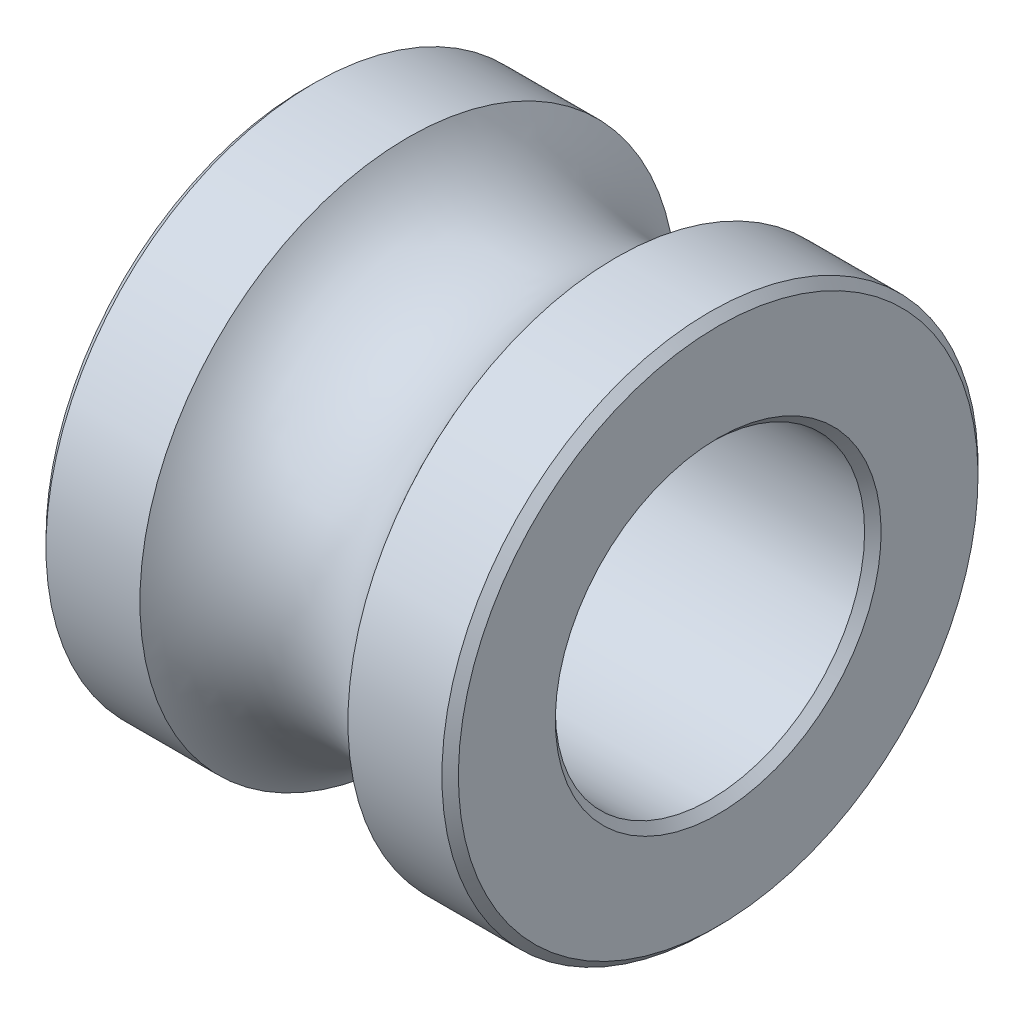
ISO-10303-21;
HEADER;
FILE_DESCRIPTION(('STEP AP214'),'2;1');
FILE_NAME('part.step','',(''),(''),'','','');
FILE_SCHEMA(('AUTOMOTIVE_DESIGN { 1 0 10303 214 1 1 1 1 }'));
ENDSEC;
DATA;
#1=APPLICATION_CONTEXT('core data for automotive mechanical design processes');
#2=APPLICATION_PROTOCOL_DEFINITION('international standard','automotive_design',2000,#1);
#3=PRODUCT_CONTEXT('',#1,'mechanical');
#4=PRODUCT('Part','Part','',(#3));
#5=PRODUCT_RELATED_PRODUCT_CATEGORY('part','',(#4));
#6=PRODUCT_DEFINITION_FORMATION('','',#4);
#7=PRODUCT_DEFINITION_CONTEXT('part definition',#1,'design');
#8=PRODUCT_DEFINITION('design','',#6,#7);
#9=PRODUCT_DEFINITION_SHAPE('','',#8);
#10=(LENGTH_UNIT() NAMED_UNIT(*) SI_UNIT(.MILLI.,.METRE.));
#11=(NAMED_UNIT(*) PLANE_ANGLE_UNIT() SI_UNIT($,.RADIAN.));
#12=(NAMED_UNIT(*) SI_UNIT($,.STERADIAN.) SOLID_ANGLE_UNIT());
#13=UNCERTAINTY_MEASURE_WITH_UNIT(LENGTH_MEASURE(1.E-05),#10,'distance_accuracy_value','');
#14=(GEOMETRIC_REPRESENTATION_CONTEXT(3) GLOBAL_UNCERTAINTY_ASSIGNED_CONTEXT((#13)) GLOBAL_UNIT_ASSIGNED_CONTEXT((#10,
#11,#12)) REPRESENTATION_CONTEXT('',''));
#15=CARTESIAN_POINT('',(0.,0.,0.));
#16=DIRECTION('',(0.,0.,1.));
#17=DIRECTION('',(1.,0.,0.));
#18=AXIS2_PLACEMENT_3D('',#15,#16,#17);
#19=CARTESIAN_POINT('',(-6.42901749222422,0.,0.));
#20=DIRECTION('',(-1.,0.,0.));
#21=DIRECTION('',(0.,-1.,0.));
#22=AXIS2_PLACEMENT_3D('',#19,#20,#21);
#23=CYLINDRICAL_SURFACE('',#22,1.5);
#24=CARTESIAN_POINT('',(-1.92,0.,0.));
#25=DIRECTION('',(-1.,0.,0.));
#26=DIRECTION('',(0.,-1.,0.));
#27=AXIS2_PLACEMENT_3D('',#24,#25,#26);
#28=CIRCLE('',#27,1.5);
#29=CARTESIAN_POINT('',(-1.92,-1.5,0.));
#30=VERTEX_POINT('',#29);
#31=EDGE_CURVE('E58',#30,#30,#28,.T.);
#32=ORIENTED_EDGE('',*,*,#31,.T.);
#33=EDGE_LOOP('',(#32));
#34=FACE_BOUND('',#33,.T.);
#35=CARTESIAN_POINT('',(1.92,0.,0.));
#36=DIRECTION('',(1.,0.,0.));
#37=DIRECTION('',(0.,1.,0.));
#38=AXIS2_PLACEMENT_3D('',#35,#36,#37);
#39=CIRCLE('',#38,1.5);
#40=CARTESIAN_POINT('',(1.92,1.5,0.));
#41=VERTEX_POINT('',#40);
#42=EDGE_CURVE('E61',#41,#41,#39,.T.);
#43=ORIENTED_EDGE('',*,*,#42,.T.);
#44=EDGE_LOOP('',(#43));
#45=FACE_BOUND('',#44,.T.);
#46=ADVANCED_FACE('F32',(#34,#45),#23,.F.);
#47=CARTESIAN_POINT('',(2.,-1.5,0.));
#48=DIRECTION('',(1.,0.,0.));
#49=DIRECTION('',(0.,1.,0.));
#50=AXIS2_PLACEMENT_3D('',#47,#48,#49);
#51=PLANE('',#50);
#52=CARTESIAN_POINT('',(2.,0.,0.));
#53=DIRECTION('',(1.,0.,0.));
#54=DIRECTION('',(0.,1.,0.));
#55=AXIS2_PLACEMENT_3D('',#52,#53,#54);
#56=CIRCLE('',#55,2.52);
#57=CARTESIAN_POINT('',(2.,2.52,0.));
#58=VERTEX_POINT('',#57);
#59=EDGE_CURVE('E10',#58,#58,#56,.T.);
#60=ORIENTED_EDGE('',*,*,#59,.T.);
#61=EDGE_LOOP('',(#60));
#62=FACE_BOUND('',#61,.T.);
#63=CARTESIAN_POINT('',(2.,0.,0.));
#64=DIRECTION('',(1.,0.,0.));
#65=DIRECTION('',(0.,1.,0.));
#66=AXIS2_PLACEMENT_3D('',#63,#64,#65);
#67=CIRCLE('',#66,1.58);
#68=CARTESIAN_POINT('',(2.,1.58,0.));
#69=VERTEX_POINT('',#68);
#70=EDGE_CURVE('E39',#69,#69,#67,.F.);
#71=ORIENTED_EDGE('',*,*,#70,.T.);
#72=EDGE_LOOP('',(#71));
#73=FACE_BOUND('',#72,.T.);
#74=ADVANCED_FACE('F85',(#62,#73),#51,.T.);
#75=CARTESIAN_POINT('',(-6.42901749222422,0.,0.));
#76=DIRECTION('',(-1.,0.,0.));
#77=DIRECTION('',(0.,-1.,0.));
#78=AXIS2_PLACEMENT_3D('',#75,#76,#77);
#79=CYLINDRICAL_SURFACE('',#78,2.6);
#80=CARTESIAN_POINT('',(1.91999999999999,0.,0.));
#81=DIRECTION('',(1.,0.,0.));
#82=DIRECTION('',(0.,1.,0.));
#83=AXIS2_PLACEMENT_3D('',#80,#81,#82);
#84=CIRCLE('',#83,2.6);
#85=CARTESIAN_POINT('',(1.91999999999999,2.6,0.));
#86=VERTEX_POINT('',#85);
#87=EDGE_CURVE('E43',#86,#86,#84,.F.);
#88=ORIENTED_EDGE('',*,*,#87,.T.);
#89=EDGE_LOOP('',(#88));
#90=FACE_BOUND('',#89,.T.);
#91=CARTESIAN_POINT('',(1.0087120500916,0.,0.));
#92=DIRECTION('',(-1.,0.,0.));
#93=DIRECTION('',(0.,-1.,0.));
#94=AXIS2_PLACEMENT_3D('',#91,#92,#93);
#95=CIRCLE('',#94,2.6);
#96=CARTESIAN_POINT('',(1.0087120500916,-2.6,0.));
#97=VERTEX_POINT('',#96);
#98=EDGE_CURVE('E64',#97,#97,#95,.T.);
#99=ORIENTED_EDGE('',*,*,#98,.F.);
#100=EDGE_LOOP('',(#99));
#101=FACE_BOUND('',#100,.T.);
#102=ADVANCED_FACE('F75',(#90,#101),#79,.T.);
#103=CARTESIAN_POINT('',(0.,0.,0.));
#104=DIRECTION('',(-1.,0.,0.));
#105=DIRECTION('',(0.,-1.,0.));
#106=AXIS2_PLACEMENT_3D('',#103,#104,#105);
#107=TOROIDAL_SURFACE('',#106,3.25,1.2);
#108=ORIENTED_EDGE('',*,*,#98,.T.);
#109=EDGE_LOOP('',(#108));
#110=FACE_BOUND('',#109,.T.);
#111=CARTESIAN_POINT('',(-1.0087120500916,0.,0.));
#112=DIRECTION('',(-1.,0.,0.));
#113=DIRECTION('',(0.,-1.,0.));
#114=AXIS2_PLACEMENT_3D('',#111,#112,#113);
#115=CIRCLE('',#114,2.6);
#116=CARTESIAN_POINT('',(-1.0087120500916,-2.6,0.));
#117=VERTEX_POINT('',#116);
#118=EDGE_CURVE('E67',#117,#117,#115,.T.);
#119=ORIENTED_EDGE('',*,*,#118,.F.);
#120=EDGE_LOOP('',(#119));
#121=FACE_BOUND('',#120,.T.);
#122=ADVANCED_FACE('F73',(#110,#121),#107,.F.);
#123=CARTESIAN_POINT('',(-6.42901749222422,0.,0.));
#124=DIRECTION('',(-1.,0.,0.));
#125=DIRECTION('',(0.,-1.,0.));
#126=AXIS2_PLACEMENT_3D('',#123,#124,#125);
#127=CYLINDRICAL_SURFACE('',#126,2.6);
#128=CARTESIAN_POINT('',(-1.92,0.,0.));
#129=DIRECTION('',(-1.,0.,0.));
#130=DIRECTION('',(0.,-1.,0.));
#131=AXIS2_PLACEMENT_3D('',#128,#129,#130);
#132=CIRCLE('',#131,2.6);
#133=CARTESIAN_POINT('',(-1.92,-2.6,0.));
#134=VERTEX_POINT('',#133);
#135=EDGE_CURVE('E47',#134,#134,#132,.F.);
#136=ORIENTED_EDGE('',*,*,#135,.T.);
#137=EDGE_LOOP('',(#136));
#138=FACE_BOUND('',#137,.T.);
#139=ORIENTED_EDGE('',*,*,#118,.T.);
#140=EDGE_LOOP('',(#139));
#141=FACE_BOUND('',#140,.T.);
#142=ADVANCED_FACE('F71',(#138,#141),#127,.T.);
#143=CARTESIAN_POINT('',(-2.,-1.5,0.));
#144=DIRECTION('',(-1.,0.,0.));
#145=DIRECTION('',(0.,-1.,0.));
#146=AXIS2_PLACEMENT_3D('',#143,#144,#145);
#147=PLANE('',#146);
#148=CARTESIAN_POINT('',(-2.,0.,0.));
#149=DIRECTION('',(-1.,0.,0.));
#150=DIRECTION('',(0.,-1.,0.));
#151=AXIS2_PLACEMENT_3D('',#148,#149,#150);
#152=CIRCLE('',#151,1.58);
#153=CARTESIAN_POINT('',(-2.,-1.58,0.));
#154=VERTEX_POINT('',#153);
#155=EDGE_CURVE('E52',#154,#154,#152,.F.);
#156=ORIENTED_EDGE('',*,*,#155,.T.);
#157=EDGE_LOOP('',(#156));
#158=FACE_BOUND('',#157,.T.);
#159=CARTESIAN_POINT('',(-2.,0.,0.));
#160=DIRECTION('',(-1.,0.,0.));
#161=DIRECTION('',(0.,-1.,0.));
#162=AXIS2_PLACEMENT_3D('',#159,#160,#161);
#163=CIRCLE('',#162,2.52);
#164=CARTESIAN_POINT('',(-2.,-2.52,0.));
#165=VERTEX_POINT('',#164);
#166=EDGE_CURVE('E55',#165,#165,#163,.T.);
#167=ORIENTED_EDGE('',*,*,#166,.T.);
#168=EDGE_LOOP('',(#167));
#169=FACE_BOUND('',#168,.T.);
#170=ADVANCED_FACE('F82',(#158,#169),#147,.T.);
#171=CARTESIAN_POINT('',(-1.92,0.,0.));
#172=DIRECTION('',(-1.,0.,0.));
#173=DIRECTION('',(0.,-1.,0.));
#174=AXIS2_PLACEMENT_3D('',#171,#172,#173);
#175=CONICAL_SURFACE('',#174,1.5,0.785398163397455);
#176=ORIENTED_EDGE('',*,*,#155,.F.);
#177=EDGE_LOOP('',(#176));
#178=FACE_BOUND('',#177,.T.);
#179=ORIENTED_EDGE('',*,*,#31,.F.);
#180=EDGE_LOOP('',(#179));
#181=FACE_BOUND('',#180,.T.);
#182=ADVANCED_FACE('F97',(#178,#181),#175,.F.);
#183=CARTESIAN_POINT('',(-2.,0.,0.));
#184=DIRECTION('',(1.,0.,0.));
#185=DIRECTION('',(0.,1.,0.));
#186=AXIS2_PLACEMENT_3D('',#183,#184,#185);
#187=CONICAL_SURFACE('',#186,2.52,0.78539816339744);
#188=ORIENTED_EDGE('',*,*,#135,.F.);
#189=EDGE_LOOP('',(#188));
#190=FACE_BOUND('',#189,.T.);
#191=ORIENTED_EDGE('',*,*,#166,.F.);
#192=EDGE_LOOP('',(#191));
#193=FACE_BOUND('',#192,.T.);
#194=ADVANCED_FACE('F100',(#190,#193),#187,.T.);
#195=CARTESIAN_POINT('',(1.91999999999999,0.,0.));
#196=DIRECTION('',(-1.,0.,0.));
#197=DIRECTION('',(0.,-1.,0.));
#198=AXIS2_PLACEMENT_3D('',#195,#196,#197);
#199=CONICAL_SURFACE('',#198,2.6,0.785398163397448);
#200=ORIENTED_EDGE('',*,*,#59,.F.);
#201=EDGE_LOOP('',(#200));
#202=FACE_BOUND('',#201,.T.);
#203=ORIENTED_EDGE('',*,*,#87,.F.);
#204=EDGE_LOOP('',(#203));
#205=FACE_BOUND('',#204,.T.);
#206=ADVANCED_FACE('F103',(#202,#205),#199,.T.);
#207=CARTESIAN_POINT('',(2.,0.,0.));
#208=DIRECTION('',(1.,0.,0.));
#209=DIRECTION('',(0.,1.,0.));
#210=AXIS2_PLACEMENT_3D('',#207,#208,#209);
#211=CONICAL_SURFACE('',#210,1.58,0.785398163397444);
#212=ORIENTED_EDGE('',*,*,#42,.F.);
#213=EDGE_LOOP('',(#212));
#214=FACE_BOUND('',#213,.T.);
#215=ORIENTED_EDGE('',*,*,#70,.F.);
#216=EDGE_LOOP('',(#215));
#217=FACE_BOUND('',#216,.T.);
#218=ADVANCED_FACE('F34',(#214,#217),#211,.F.);
#219=CLOSED_SHELL('',(#46,#74,#102,#122,#142,#170,#182,#194,#206,#218));
#220=MANIFOLD_SOLID_BREP('B2',#219);
#221=ADVANCED_BREP_SHAPE_REPRESENTATION('',(#18,#220),#14);
#222=SHAPE_DEFINITION_REPRESENTATION(#9,#221);
ENDSEC;
END-ISO-10303-21;
